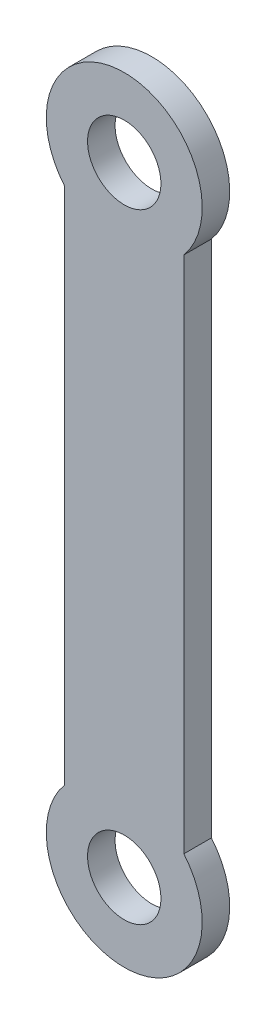
ISO-10303-21;
HEADER;
FILE_DESCRIPTION(('STEP AP214'),'2;1');
FILE_NAME('part.step','',(''),(''),'','','');
FILE_SCHEMA(('AUTOMOTIVE_DESIGN { 1 0 10303 214 1 1 1 1 }'));
ENDSEC;
DATA;
#1=APPLICATION_CONTEXT('core data for automotive mechanical design processes');
#2=APPLICATION_PROTOCOL_DEFINITION('international standard','automotive_design',2000,#1);
#3=PRODUCT_CONTEXT('',#1,'mechanical');
#4=PRODUCT('Part','Part','',(#3));
#5=PRODUCT_RELATED_PRODUCT_CATEGORY('part','',(#4));
#6=PRODUCT_DEFINITION_FORMATION('','',#4);
#7=PRODUCT_DEFINITION_CONTEXT('part definition',#1,'design');
#8=PRODUCT_DEFINITION('design','',#6,#7);
#9=PRODUCT_DEFINITION_SHAPE('','',#8);
#10=(LENGTH_UNIT() NAMED_UNIT(*) SI_UNIT(.MILLI.,.METRE.));
#11=(NAMED_UNIT(*) PLANE_ANGLE_UNIT() SI_UNIT($,.RADIAN.));
#12=(NAMED_UNIT(*) SI_UNIT($,.STERADIAN.) SOLID_ANGLE_UNIT());
#13=UNCERTAINTY_MEASURE_WITH_UNIT(LENGTH_MEASURE(1.E-05),#10,'distance_accuracy_value','');
#14=(GEOMETRIC_REPRESENTATION_CONTEXT(3) GLOBAL_UNCERTAINTY_ASSIGNED_CONTEXT((#13)) GLOBAL_UNIT_ASSIGNED_CONTEXT((#10,
#11,#12)) REPRESENTATION_CONTEXT('',''));
#15=CARTESIAN_POINT('',(0.,0.,0.));
#16=DIRECTION('',(0.,0.,1.));
#17=DIRECTION('',(1.,0.,0.));
#18=AXIS2_PLACEMENT_3D('',#15,#16,#17);
#19=CARTESIAN_POINT('',(-13.,0.,6.));
#20=DIRECTION('',(1.,0.,0.));
#21=DIRECTION('',(0.,1.,0.));
#22=AXIS2_PLACEMENT_3D('',#19,#20,#21);
#23=PLANE('',#22);
#24=DIRECTION('',(0.,-1.,0.));
#25=VECTOR('',#24,1.);
#26=CARTESIAN_POINT('',(-13.,0.,0.));
#27=LINE('',#26,#25);
#28=CARTESIAN_POINT('',(-13.,124.045548849897,0.));
#29=VERTEX_POINT('',#28);
#30=CARTESIAN_POINT('',(-13.,10.9544511501033,0.));
#31=VERTEX_POINT('',#30);
#32=EDGE_CURVE('E105',#29,#31,#27,.T.);
#33=ORIENTED_EDGE('',*,*,#32,.T.);
#34=DIRECTION('',(0.,0.,-1.));
#35=VECTOR('',#34,1.);
#36=CARTESIAN_POINT('',(-13.,10.9544511501033,6.));
#37=LINE('',#36,#35);
#38=CARTESIAN_POINT('',(-13.,10.9544511501033,6.));
#39=VERTEX_POINT('',#38);
#40=EDGE_CURVE('E11',#39,#31,#37,.T.);
#41=ORIENTED_EDGE('',*,*,#40,.F.);
#42=DIRECTION('',(0.,-1.,0.));
#43=VECTOR('',#42,1.);
#44=CARTESIAN_POINT('',(-13.,0.,6.));
#45=LINE('',#44,#43);
#46=CARTESIAN_POINT('',(-13.,124.045548849897,6.));
#47=VERTEX_POINT('',#46);
#48=EDGE_CURVE('E87',#47,#39,#45,.T.);
#49=ORIENTED_EDGE('',*,*,#48,.F.);
#50=DIRECTION('',(0.,0.,-1.));
#51=VECTOR('',#50,1.);
#52=CARTESIAN_POINT('',(-13.,124.045548849897,6.));
#53=LINE('',#52,#51);
#54=EDGE_CURVE('E104',#47,#29,#53,.T.);
#55=ORIENTED_EDGE('',*,*,#54,.T.);
#56=EDGE_LOOP('',(#33,#41,#49,#55));
#57=FACE_BOUND('',#56,.T.);
#58=ADVANCED_FACE('F35',(#57),#23,.F.);
#59=CARTESIAN_POINT('',(0.,0.,6.));
#60=DIRECTION('',(0.,0.,-1.));
#61=DIRECTION('',(-1.,0.,0.));
#62=AXIS2_PLACEMENT_3D('',#59,#60,#61);
#63=CYLINDRICAL_SURFACE('',#62,17.);
#64=CARTESIAN_POINT('',(0.,0.,0.));
#65=DIRECTION('',(0.,0.,1.));
#66=DIRECTION('',(1.,0.,0.));
#67=AXIS2_PLACEMENT_3D('',#64,#65,#66);
#68=CIRCLE('',#67,17.);
#69=CARTESIAN_POINT('',(13.,10.9544511501033,0.));
#70=VERTEX_POINT('',#69);
#71=EDGE_CURVE('E91',#31,#70,#68,.T.);
#72=ORIENTED_EDGE('',*,*,#71,.T.);
#73=DIRECTION('',(0.,0.,-1.));
#74=VECTOR('',#73,1.);
#75=CARTESIAN_POINT('',(13.,10.9544511501033,6.));
#76=LINE('',#75,#74);
#77=CARTESIAN_POINT('',(13.,10.9544511501033,6.));
#78=VERTEX_POINT('',#77);
#79=EDGE_CURVE('E43',#78,#70,#76,.T.);
#80=ORIENTED_EDGE('',*,*,#79,.F.);
#81=CARTESIAN_POINT('',(0.,0.,6.));
#82=DIRECTION('',(0.,0.,1.));
#83=DIRECTION('',(1.,0.,0.));
#84=AXIS2_PLACEMENT_3D('',#81,#82,#83);
#85=CIRCLE('',#84,17.);
#86=EDGE_CURVE('E81',#39,#78,#85,.T.);
#87=ORIENTED_EDGE('',*,*,#86,.F.);
#88=ORIENTED_EDGE('',*,*,#40,.T.);
#89=EDGE_LOOP('',(#72,#80,#87,#88));
#90=FACE_BOUND('',#89,.T.);
#91=ADVANCED_FACE('F90',(#90),#63,.T.);
#92=CARTESIAN_POINT('',(13.,0.,6.));
#93=DIRECTION('',(-1.,0.,0.));
#94=DIRECTION('',(0.,0.,1.));
#95=AXIS2_PLACEMENT_3D('',#92,#93,#94);
#96=PLANE('',#95);
#97=DIRECTION('',(0.,1.,0.));
#98=VECTOR('',#97,1.);
#99=CARTESIAN_POINT('',(13.,0.,0.));
#100=LINE('',#99,#98);
#101=CARTESIAN_POINT('',(13.,124.045548849897,0.));
#102=VERTEX_POINT('',#101);
#103=EDGE_CURVE('E68',#70,#102,#100,.T.);
#104=ORIENTED_EDGE('',*,*,#103,.T.);
#105=DIRECTION('',(0.,0.,-1.));
#106=VECTOR('',#105,1.);
#107=CARTESIAN_POINT('',(13.,124.045548849897,6.));
#108=LINE('',#107,#106);
#109=CARTESIAN_POINT('',(13.,124.045548849897,6.));
#110=VERTEX_POINT('',#109);
#111=EDGE_CURVE('E92',#110,#102,#108,.T.);
#112=ORIENTED_EDGE('',*,*,#111,.F.);
#113=DIRECTION('',(0.,1.,0.));
#114=VECTOR('',#113,1.);
#115=CARTESIAN_POINT('',(13.,0.,6.));
#116=LINE('',#115,#114);
#117=EDGE_CURVE('E85',#78,#110,#116,.T.);
#118=ORIENTED_EDGE('',*,*,#117,.F.);
#119=ORIENTED_EDGE('',*,*,#79,.T.);
#120=EDGE_LOOP('',(#104,#112,#118,#119));
#121=FACE_BOUND('',#120,.T.);
#122=ADVANCED_FACE('F93',(#121),#96,.F.);
#123=CARTESIAN_POINT('',(0.,0.,6.));
#124=DIRECTION('',(0.,0.,-1.));
#125=DIRECTION('',(-1.,0.,0.));
#126=AXIS2_PLACEMENT_3D('',#123,#124,#125);
#127=CYLINDRICAL_SURFACE('',#126,8.);
#128=CARTESIAN_POINT('',(0.,0.,6.));
#129=DIRECTION('',(0.,0.,1.));
#130=DIRECTION('',(1.,0.,0.));
#131=AXIS2_PLACEMENT_3D('',#128,#129,#130);
#132=CIRCLE('',#131,8.);
#133=CARTESIAN_POINT('',(8.,0.,6.));
#134=VERTEX_POINT('',#133);
#135=EDGE_CURVE('E95',#134,#134,#132,.T.);
#136=ORIENTED_EDGE('',*,*,#135,.T.);
#137=EDGE_LOOP('',(#136));
#138=FACE_BOUND('',#137,.T.);
#139=CARTESIAN_POINT('',(0.,0.,0.));
#140=DIRECTION('',(0.,0.,1.));
#141=DIRECTION('',(1.,0.,0.));
#142=AXIS2_PLACEMENT_3D('',#139,#140,#141);
#143=CIRCLE('',#142,8.);
#144=CARTESIAN_POINT('',(8.,0.,0.));
#145=VERTEX_POINT('',#144);
#146=EDGE_CURVE('E111',#145,#145,#143,.T.);
#147=ORIENTED_EDGE('',*,*,#146,.F.);
#148=EDGE_LOOP('',(#147));
#149=FACE_BOUND('',#148,.T.);
#150=ADVANCED_FACE('F131',(#138,#149),#127,.F.);
#151=CARTESIAN_POINT('',(0.,135.,6.));
#152=DIRECTION('',(0.,0.,-1.));
#153=DIRECTION('',(-1.,0.,0.));
#154=AXIS2_PLACEMENT_3D('',#151,#152,#153);
#155=CYLINDRICAL_SURFACE('',#154,17.);
#156=CARTESIAN_POINT('',(0.,135.,0.));
#157=DIRECTION('',(0.,0.,1.));
#158=DIRECTION('',(1.,0.,0.));
#159=AXIS2_PLACEMENT_3D('',#156,#157,#158);
#160=CIRCLE('',#159,17.);
#161=EDGE_CURVE('E74',#102,#29,#160,.T.);
#162=ORIENTED_EDGE('',*,*,#161,.T.);
#163=ORIENTED_EDGE('',*,*,#54,.F.);
#164=CARTESIAN_POINT('',(0.,135.,6.));
#165=DIRECTION('',(0.,0.,1.));
#166=DIRECTION('',(1.,0.,0.));
#167=AXIS2_PLACEMENT_3D('',#164,#165,#166);
#168=CIRCLE('',#167,17.);
#169=EDGE_CURVE('E51',#110,#47,#168,.T.);
#170=ORIENTED_EDGE('',*,*,#169,.F.);
#171=ORIENTED_EDGE('',*,*,#111,.T.);
#172=EDGE_LOOP('',(#162,#163,#170,#171));
#173=FACE_BOUND('',#172,.T.);
#174=ADVANCED_FACE('F118',(#173),#155,.T.);
#175=CARTESIAN_POINT('',(0.,135.,6.));
#176=DIRECTION('',(0.,0.,-1.));
#177=DIRECTION('',(-1.,0.,0.));
#178=AXIS2_PLACEMENT_3D('',#175,#176,#177);
#179=CYLINDRICAL_SURFACE('',#178,8.00000000000001);
#180=CARTESIAN_POINT('',(0.,135.,6.));
#181=DIRECTION('',(0.,0.,1.));
#182=DIRECTION('',(1.,0.,0.));
#183=AXIS2_PLACEMENT_3D('',#180,#181,#182);
#184=CIRCLE('',#183,8.00000000000001);
#185=CARTESIAN_POINT('',(8.00000000000001,135.,6.));
#186=VERTEX_POINT('',#185);
#187=EDGE_CURVE('E101',#186,#186,#184,.T.);
#188=ORIENTED_EDGE('',*,*,#187,.T.);
#189=EDGE_LOOP('',(#188));
#190=FACE_BOUND('',#189,.T.);
#191=CARTESIAN_POINT('',(0.,135.,0.));
#192=DIRECTION('',(0.,0.,1.));
#193=DIRECTION('',(1.,0.,0.));
#194=AXIS2_PLACEMENT_3D('',#191,#192,#193);
#195=CIRCLE('',#194,8.00000000000001);
#196=CARTESIAN_POINT('',(8.00000000000001,135.,0.));
#197=VERTEX_POINT('',#196);
#198=EDGE_CURVE('E114',#197,#197,#195,.T.);
#199=ORIENTED_EDGE('',*,*,#198,.F.);
#200=EDGE_LOOP('',(#199));
#201=FACE_BOUND('',#200,.T.);
#202=ADVANCED_FACE('F136',(#190,#201),#179,.F.);
#203=CARTESIAN_POINT('',(0.,0.,6.));
#204=DIRECTION('',(0.,0.,1.));
#205=DIRECTION('',(1.,0.,0.));
#206=AXIS2_PLACEMENT_3D('',#203,#204,#205);
#207=PLANE('',#206);
#208=ORIENTED_EDGE('',*,*,#48,.T.);
#209=ORIENTED_EDGE('',*,*,#86,.T.);
#210=ORIENTED_EDGE('',*,*,#117,.T.);
#211=ORIENTED_EDGE('',*,*,#169,.T.);
#212=EDGE_LOOP('',(#208,#209,#210,#211));
#213=FACE_BOUND('',#212,.T.);
#214=ORIENTED_EDGE('',*,*,#135,.F.);
#215=EDGE_LOOP('',(#214));
#216=FACE_BOUND('',#215,.T.);
#217=ORIENTED_EDGE('',*,*,#187,.F.);
#218=EDGE_LOOP('',(#217));
#219=FACE_BOUND('',#218,.T.);
#220=ADVANCED_FACE('F82',(#213,#216,#219),#207,.T.);
#221=CARTESIAN_POINT('',(0.,0.,0.));
#222=DIRECTION('',(0.,0.,1.));
#223=DIRECTION('',(1.,0.,0.));
#224=AXIS2_PLACEMENT_3D('',#221,#222,#223);
#225=PLANE('',#224);
#226=ORIENTED_EDGE('',*,*,#32,.F.);
#227=ORIENTED_EDGE('',*,*,#161,.F.);
#228=ORIENTED_EDGE('',*,*,#103,.F.);
#229=ORIENTED_EDGE('',*,*,#71,.F.);
#230=EDGE_LOOP('',(#226,#227,#228,#229));
#231=FACE_BOUND('',#230,.T.);
#232=ORIENTED_EDGE('',*,*,#146,.T.);
#233=EDGE_LOOP('',(#232));
#234=FACE_BOUND('',#233,.T.);
#235=ORIENTED_EDGE('',*,*,#198,.T.);
#236=EDGE_LOOP('',(#235));
#237=FACE_BOUND('',#236,.T.);
#238=ADVANCED_FACE('F121',(#231,#234,#237),#225,.F.);
#239=CLOSED_SHELL('',(#58,#91,#122,#150,#174,#202,#220,#238));
#240=MANIFOLD_SOLID_BREP('B2',#239);
#241=ADVANCED_BREP_SHAPE_REPRESENTATION('',(#18,#240),#14);
#242=SHAPE_DEFINITION_REPRESENTATION(#9,#241);
ENDSEC;
END-ISO-10303-21;
